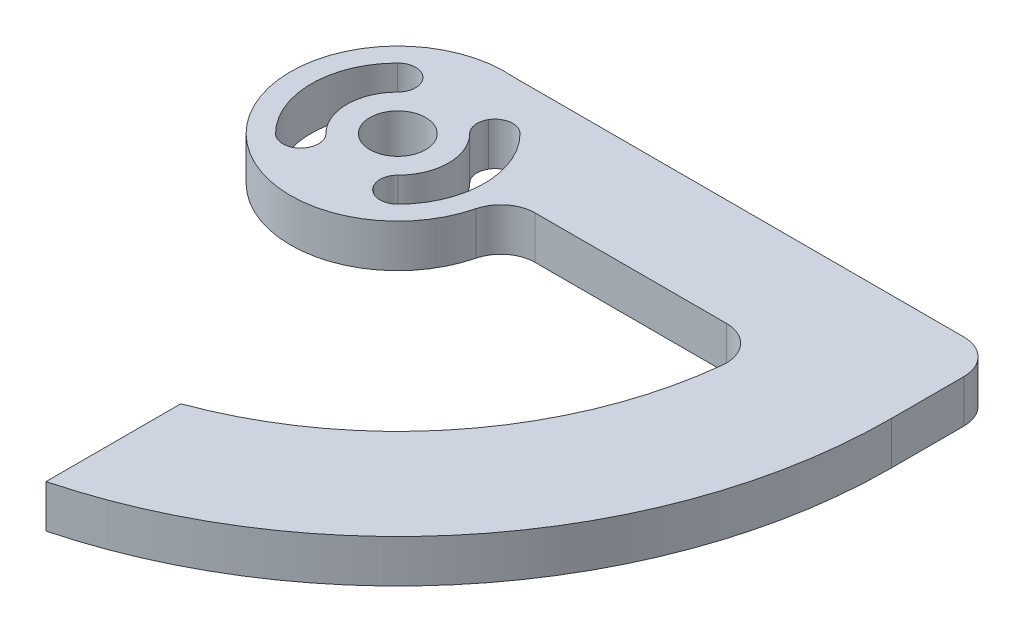
ISO-10303-21;
HEADER;
FILE_DESCRIPTION(('STEP AP214'),'2;1');
FILE_NAME('part.step','',(''),(''),'','','');
FILE_SCHEMA(('AUTOMOTIVE_DESIGN { 1 0 10303 214 1 1 1 1 }'));
ENDSEC;
DATA;
#1=APPLICATION_CONTEXT('core data for automotive mechanical design processes');
#2=APPLICATION_PROTOCOL_DEFINITION('international standard','automotive_design',2000,#1);
#3=PRODUCT_CONTEXT('',#1,'mechanical');
#4=PRODUCT('Part','Part','',(#3));
#5=PRODUCT_RELATED_PRODUCT_CATEGORY('part','',(#4));
#6=PRODUCT_DEFINITION_FORMATION('','',#4);
#7=PRODUCT_DEFINITION_CONTEXT('part definition',#1,'design');
#8=PRODUCT_DEFINITION('design','',#6,#7);
#9=PRODUCT_DEFINITION_SHAPE('','',#8);
#10=(LENGTH_UNIT() NAMED_UNIT(*) SI_UNIT(.MILLI.,.METRE.));
#11=(NAMED_UNIT(*) PLANE_ANGLE_UNIT() SI_UNIT($,.RADIAN.));
#12=(NAMED_UNIT(*) SI_UNIT($,.STERADIAN.) SOLID_ANGLE_UNIT());
#13=UNCERTAINTY_MEASURE_WITH_UNIT(LENGTH_MEASURE(1.E-05),#10,'distance_accuracy_value','');
#14=(GEOMETRIC_REPRESENTATION_CONTEXT(3) GLOBAL_UNCERTAINTY_ASSIGNED_CONTEXT((#13)) GLOBAL_UNIT_ASSIGNED_CONTEXT((#10,
#11,#12)) REPRESENTATION_CONTEXT('',''));
#15=CARTESIAN_POINT('',(0.,0.,0.));
#16=DIRECTION('',(0.,0.,1.));
#17=DIRECTION('',(1.,0.,0.));
#18=AXIS2_PLACEMENT_3D('',#15,#16,#17);
#19=CARTESIAN_POINT('',(0.,5.,0.));
#20=DIRECTION('',(0.,1.,0.));
#21=DIRECTION('',(0.,0.,1.));
#22=AXIS2_PLACEMENT_3D('',#19,#20,#21);
#23=PLANE('',#22);
#24=DIRECTION('',(0.,0.,1.));
#25=VECTOR('',#24,1.);
#26=CARTESIAN_POINT('',(14.6185852361367,5.,37.5897138926267));
#27=LINE('',#26,#25);
#28=CARTESIAN_POINT('',(14.6185852361367,5.,39.9067283261082));
#29=VERTEX_POINT('',#28);
#30=CARTESIAN_POINT('',(14.6185852361367,5.,55.6106731275014));
#31=VERTEX_POINT('',#30);
#32=EDGE_CURVE('E49',#29,#31,#27,.T.);
#33=ORIENTED_EDGE('',*,*,#32,.T.);
#34=CARTESIAN_POINT('',(0.,5.,0.));
#35=DIRECTION('',(0.,1.,0.));
#36=DIRECTION('',(1.,0.,0.));
#37=AXIS2_PLACEMENT_3D('',#34,#35,#36);
#38=CIRCLE('',#37,57.5);
#39=CARTESIAN_POINT('',(57.5,5.,0.));
#40=VERTEX_POINT('',#39);
#41=EDGE_CURVE('E198',#31,#40,#38,.T.);
#42=ORIENTED_EDGE('',*,*,#41,.T.);
#43=DIRECTION('',(0.,0.,-1.));
#44=VECTOR('',#43,1.);
#45=CARTESIAN_POINT('',(57.5,5.,0.));
#46=LINE('',#45,#44);
#47=CARTESIAN_POINT('',(57.5,5.,-8.45993579437712));
#48=VERTEX_POINT('',#47);
#49=EDGE_CURVE('E219',#40,#48,#46,.T.);
#50=ORIENTED_EDGE('',*,*,#49,.T.);
#51=CARTESIAN_POINT('',(53.5,5.,-8.45993579437712));
#52=DIRECTION('',(0.,1.,0.));
#53=DIRECTION('',(0.,0.,1.));
#54=AXIS2_PLACEMENT_3D('',#51,#52,#53);
#55=CIRCLE('',#54,4.);
#56=CARTESIAN_POINT('',(53.5,5.,-12.4599357943771));
#57=VERTEX_POINT('',#56);
#58=EDGE_CURVE('E329',#48,#57,#55,.T.);
#59=ORIENTED_EDGE('',*,*,#58,.T.);
#60=DIRECTION('',(-1.,0.,0.));
#61=VECTOR('',#60,1.);
#62=CARTESIAN_POINT('',(57.5,5.,-12.4599357943771));
#63=LINE('',#62,#61);
#64=CARTESIAN_POINT('',(0.999999999999985,5.,-12.4599357943771));
#65=VERTEX_POINT('',#64);
#66=EDGE_CURVE('E216',#57,#65,#63,.T.);
#67=ORIENTED_EDGE('',*,*,#66,.T.);
#68=CARTESIAN_POINT('',(0.,5.,0.));
#69=DIRECTION('',(0.,1.,0.));
#70=DIRECTION('',(0.,0.,1.));
#71=AXIS2_PLACEMENT_3D('',#68,#69,#70);
#72=CIRCLE('',#71,12.5);
#73=CARTESIAN_POINT('',(12.1271292375622,5.,3.03030303030303));
#74=VERTEX_POINT('',#73);
#75=EDGE_CURVE('E228',#65,#74,#72,.T.);
#76=ORIENTED_EDGE('',*,*,#75,.T.);
#77=CARTESIAN_POINT('',(16.0078105935821,5.,4.00000000000001));
#78=DIRECTION('',(0.,1.,0.));
#79=DIRECTION('',(0.,0.,1.));
#80=AXIS2_PLACEMENT_3D('',#77,#78,#79);
#81=CIRCLE('',#80,4.);
#82=CARTESIAN_POINT('',(16.0078105935821,5.,0.));
#83=VERTEX_POINT('',#82);
#84=EDGE_CURVE('E334',#74,#83,#81,.F.);
#85=ORIENTED_EDGE('',*,*,#84,.T.);
#86=DIRECTION('',(1.,0.,0.));
#87=VECTOR('',#86,1.);
#88=CARTESIAN_POINT('',(57.5,5.,0.));
#89=LINE('',#88,#87);
#90=CARTESIAN_POINT('',(38.2916439970916,5.,0.));
#91=VERTEX_POINT('',#90);
#92=EDGE_CURVE('E208',#83,#91,#89,.T.);
#93=ORIENTED_EDGE('',*,*,#92,.T.);
#94=CARTESIAN_POINT('',(38.2916439970916,5.,4.));
#95=DIRECTION('',(0.,1.,0.));
#96=DIRECTION('',(0.,0.,1.));
#97=AXIS2_PLACEMENT_3D('',#94,#95,#96);
#98=CIRCLE('',#97,4.);
#99=CARTESIAN_POINT('',(42.269996620166,5.,4.41558441558442));
#100=VERTEX_POINT('',#99);
#101=EDGE_CURVE('E43',#91,#100,#98,.F.);
#102=ORIENTED_EDGE('',*,*,#101,.T.);
#103=CARTESIAN_POINT('',(0.,5.,0.));
#104=DIRECTION('',(0.,1.,0.));
#105=DIRECTION('',(1.,0.,0.));
#106=AXIS2_PLACEMENT_3D('',#103,#104,#105);
#107=CIRCLE('',#106,42.5);
#108=EDGE_CURVE('E56',#29,#100,#107,.T.);
#109=ORIENTED_EDGE('',*,*,#108,.F.);
#110=EDGE_LOOP('',(#33,#42,#50,#59,#67,#76,#85,#93,#102,#109));
#111=FACE_BOUND('',#110,.T.);
#112=CARTESIAN_POINT('',(-5.66010946131306,5.,-5.65359716339557));
#113=DIRECTION('',(0.,1.,0.));
#114=DIRECTION('',(0.,0.,1.));
#115=AXIS2_PLACEMENT_3D('',#112,#113,#114);
#116=CIRCLE('',#115,2.075);
#117=CARTESIAN_POINT('',(-7.12820035284113,5.,-7.11999892765129));
#118=VERTEX_POINT('',#117);
#119=CARTESIAN_POINT('',(-3.86310674846034,5.,-6.69109716339556));
#120=VERTEX_POINT('',#119);
#121=EDGE_CURVE('E277',#118,#120,#116,.F.);
#122=ORIENTED_EDGE('',*,*,#121,.T.);
#123=CARTESIAN_POINT('',(-5.66010946131306,5.,-5.65359716339557));
#124=DIRECTION('',(0.,1.,0.));
#125=DIRECTION('',(0.,0.,1.));
#126=AXIS2_PLACEMENT_3D('',#123,#124,#125);
#127=CIRCLE('',#126,2.075);
#128=CARTESIAN_POINT('',(-4.19201856978498,5.,-4.18719539913984));
#129=VERTEX_POINT('',#128);
#130=EDGE_CURVE('E281',#120,#129,#127,.F.);
#131=ORIENTED_EDGE('',*,*,#130,.T.);
#132=CARTESIAN_POINT('',(0.,5.,0.));
#133=DIRECTION('',(0.,1.,0.));
#134=DIRECTION('',(0.,0.,1.));
#135=AXIS2_PLACEMENT_3D('',#132,#133,#134);
#136=CIRCLE('',#135,5.925);
#137=CARTESIAN_POINT('',(-4.19201856978499,5.,4.18719539913984));
#138=VERTEX_POINT('',#137);
#139=EDGE_CURVE('E234',#129,#138,#136,.T.);
#140=ORIENTED_EDGE('',*,*,#139,.T.);
#141=CARTESIAN_POINT('',(-5.66010946131306,5.,5.65359716339556));
#142=DIRECTION('',(0.,1.,0.));
#143=DIRECTION('',(0.,0.,1.));
#144=AXIS2_PLACEMENT_3D('',#141,#142,#143);
#145=CIRCLE('',#144,2.075);
#146=CARTESIAN_POINT('',(-3.86310674846035,5.,6.69109716339556));
#147=VERTEX_POINT('',#146);
#148=EDGE_CURVE('E297',#138,#147,#145,.F.);
#149=ORIENTED_EDGE('',*,*,#148,.T.);
#150=CARTESIAN_POINT('',(-5.66010946131306,5.,5.65359716339556));
#151=DIRECTION('',(0.,1.,0.));
#152=DIRECTION('',(0.,0.,1.));
#153=AXIS2_PLACEMENT_3D('',#150,#151,#152);
#154=CIRCLE('',#153,2.075);
#155=CARTESIAN_POINT('',(-7.12820035284114,5.,7.11999892765129));
#156=VERTEX_POINT('',#155);
#157=EDGE_CURVE('E293',#147,#156,#154,.F.);
#158=ORIENTED_EDGE('',*,*,#157,.T.);
#159=CARTESIAN_POINT('',(0.,5.,0.));
#160=DIRECTION('',(0.,1.,0.));
#161=DIRECTION('',(0.,0.,1.));
#162=AXIS2_PLACEMENT_3D('',#159,#160,#161);
#163=CIRCLE('',#162,10.075);
#164=EDGE_CURVE('E237',#118,#156,#163,.T.);
#165=ORIENTED_EDGE('',*,*,#164,.F.);
#166=EDGE_LOOP('',(#122,#131,#140,#149,#158,#165));
#167=FACE_BOUND('',#166,.T.);
#168=CARTESIAN_POINT('',(0.,5.,0.));
#169=DIRECTION('',(0.,1.,0.));
#170=DIRECTION('',(0.,0.,1.));
#171=AXIS2_PLACEMENT_3D('',#168,#169,#170);
#172=CIRCLE('',#171,3.25);
#173=CARTESIAN_POINT('',(0.,5.,3.25));
#174=VERTEX_POINT('',#173);
#175=EDGE_CURVE('E201',#174,#174,#172,.T.);
#176=ORIENTED_EDGE('',*,*,#175,.F.);
#177=EDGE_LOOP('',(#176));
#178=FACE_BOUND('',#177,.T.);
#179=CARTESIAN_POINT('',(5.66010946131306,5.,-5.65359716339557));
#180=DIRECTION('',(0.,1.,0.));
#181=DIRECTION('',(0.,0.,1.));
#182=AXIS2_PLACEMENT_3D('',#179,#180,#181);
#183=CIRCLE('',#182,2.075);
#184=CARTESIAN_POINT('',(4.19201856978498,5.,-4.18719539913984));
#185=VERTEX_POINT('',#184);
#186=CARTESIAN_POINT('',(3.86310674846034,5.,-6.69109716339556));
#187=VERTEX_POINT('',#186);
#188=EDGE_CURVE('E269',#185,#187,#183,.F.);
#189=ORIENTED_EDGE('',*,*,#188,.T.);
#190=CARTESIAN_POINT('',(5.66010946131306,5.,-5.65359716339557));
#191=DIRECTION('',(0.,1.,0.));
#192=DIRECTION('',(0.,0.,1.));
#193=AXIS2_PLACEMENT_3D('',#190,#191,#192);
#194=CIRCLE('',#193,2.075);
#195=CARTESIAN_POINT('',(7.12820035284113,5.,-7.11999892765129));
#196=VERTEX_POINT('',#195);
#197=EDGE_CURVE('E273',#187,#196,#194,.F.);
#198=ORIENTED_EDGE('',*,*,#197,.T.);
#199=CARTESIAN_POINT('',(0.,5.,0.));
#200=DIRECTION('',(0.,1.,0.));
#201=DIRECTION('',(0.,0.,1.));
#202=AXIS2_PLACEMENT_3D('',#199,#200,#201);
#203=CIRCLE('',#202,10.075);
#204=CARTESIAN_POINT('',(7.12820035284114,5.,7.11999892765129));
#205=VERTEX_POINT('',#204);
#206=EDGE_CURVE('E245',#196,#205,#203,.F.);
#207=ORIENTED_EDGE('',*,*,#206,.T.);
#208=CARTESIAN_POINT('',(5.66010946131306,5.,5.65359716339556));
#209=DIRECTION('',(0.,1.,0.));
#210=DIRECTION('',(0.,0.,1.));
#211=AXIS2_PLACEMENT_3D('',#208,#209,#210);
#212=CIRCLE('',#211,2.075);
#213=CARTESIAN_POINT('',(3.86310674846035,5.,6.69109716339556));
#214=VERTEX_POINT('',#213);
#215=EDGE_CURVE('E289',#205,#214,#212,.F.);
#216=ORIENTED_EDGE('',*,*,#215,.T.);
#217=CARTESIAN_POINT('',(5.66010946131306,5.,5.65359716339556));
#218=DIRECTION('',(0.,1.,0.));
#219=DIRECTION('',(0.,0.,1.));
#220=AXIS2_PLACEMENT_3D('',#217,#218,#219);
#221=CIRCLE('',#220,2.075);
#222=CARTESIAN_POINT('',(4.19201856978499,5.,4.18719539913984));
#223=VERTEX_POINT('',#222);
#224=EDGE_CURVE('E285',#214,#223,#221,.F.);
#225=ORIENTED_EDGE('',*,*,#224,.T.);
#226=CARTESIAN_POINT('',(0.,5.,0.));
#227=DIRECTION('',(0.,1.,0.));
#228=DIRECTION('',(0.,0.,1.));
#229=AXIS2_PLACEMENT_3D('',#226,#227,#228);
#230=CIRCLE('',#229,5.925);
#231=EDGE_CURVE('E242',#185,#223,#230,.F.);
#232=ORIENTED_EDGE('',*,*,#231,.F.);
#233=EDGE_LOOP('',(#189,#198,#207,#216,#225,#232));
#234=FACE_BOUND('',#233,.T.);
#235=ADVANCED_FACE('F35',(#111,#167,#178,#234),#23,.T.);
#236=CARTESIAN_POINT('',(0.,0.,0.));
#237=DIRECTION('',(0.,1.,0.));
#238=DIRECTION('',(0.,0.,1.));
#239=AXIS2_PLACEMENT_3D('',#236,#237,#238);
#240=PLANE('',#239);
#241=CARTESIAN_POINT('',(0.,0.,0.));
#242=DIRECTION('',(0.,1.,0.));
#243=DIRECTION('',(1.,0.,0.));
#244=AXIS2_PLACEMENT_3D('',#241,#242,#243);
#245=CIRCLE('',#244,57.5);
#246=CARTESIAN_POINT('',(14.6185852361367,0.,55.6106731275014));
#247=VERTEX_POINT('',#246);
#248=CARTESIAN_POINT('',(57.5,0.,0.));
#249=VERTEX_POINT('',#248);
#250=EDGE_CURVE('E193',#247,#249,#245,.T.);
#251=ORIENTED_EDGE('',*,*,#250,.F.);
#252=DIRECTION('',(0.,0.,1.));
#253=VECTOR('',#252,1.);
#254=CARTESIAN_POINT('',(14.6185852361367,0.,37.5897138926267));
#255=LINE('',#254,#253);
#256=CARTESIAN_POINT('',(14.6185852361367,0.,39.9067283261082));
#257=VERTEX_POINT('',#256);
#258=EDGE_CURVE('E183',#257,#247,#255,.T.);
#259=ORIENTED_EDGE('',*,*,#258,.F.);
#260=CARTESIAN_POINT('',(0.,0.,0.));
#261=DIRECTION('',(0.,1.,0.));
#262=DIRECTION('',(1.,0.,0.));
#263=AXIS2_PLACEMENT_3D('',#260,#261,#262);
#264=CIRCLE('',#263,42.5);
#265=CARTESIAN_POINT('',(42.269996620166,0.,4.41558441558442));
#266=VERTEX_POINT('',#265);
#267=EDGE_CURVE('E190',#257,#266,#264,.T.);
#268=ORIENTED_EDGE('',*,*,#267,.T.);
#269=CARTESIAN_POINT('',(38.2916439970916,0.,4.));
#270=DIRECTION('',(0.,1.,0.));
#271=DIRECTION('',(0.,0.,1.));
#272=AXIS2_PLACEMENT_3D('',#269,#270,#271);
#273=CIRCLE('',#272,4.);
#274=CARTESIAN_POINT('',(38.2916439970916,0.,0.));
#275=VERTEX_POINT('',#274);
#276=EDGE_CURVE('E336',#266,#275,#273,.T.);
#277=ORIENTED_EDGE('',*,*,#276,.T.);
#278=DIRECTION('',(1.,0.,0.));
#279=VECTOR('',#278,1.);
#280=CARTESIAN_POINT('',(57.5,0.,0.));
#281=LINE('',#280,#279);
#282=CARTESIAN_POINT('',(16.0078105935821,0.,0.));
#283=VERTEX_POINT('',#282);
#284=EDGE_CURVE('E205',#283,#275,#281,.T.);
#285=ORIENTED_EDGE('',*,*,#284,.F.);
#286=CARTESIAN_POINT('',(16.0078105935821,0.,4.00000000000001));
#287=DIRECTION('',(0.,1.,0.));
#288=DIRECTION('',(0.,0.,1.));
#289=AXIS2_PLACEMENT_3D('',#286,#287,#288);
#290=CIRCLE('',#289,4.);
#291=CARTESIAN_POINT('',(12.1271292375622,0.,3.03030303030303));
#292=VERTEX_POINT('',#291);
#293=EDGE_CURVE('E332',#283,#292,#290,.T.);
#294=ORIENTED_EDGE('',*,*,#293,.T.);
#295=CARTESIAN_POINT('',(0.,0.,0.));
#296=DIRECTION('',(0.,1.,0.));
#297=DIRECTION('',(0.,0.,1.));
#298=AXIS2_PLACEMENT_3D('',#295,#296,#297);
#299=CIRCLE('',#298,12.5);
#300=CARTESIAN_POINT('',(0.999999999999985,0.,-12.4599357943771));
#301=VERTEX_POINT('',#300);
#302=EDGE_CURVE('E218',#301,#292,#299,.T.);
#303=ORIENTED_EDGE('',*,*,#302,.F.);
#304=DIRECTION('',(-1.,0.,0.));
#305=VECTOR('',#304,1.);
#306=CARTESIAN_POINT('',(57.5,0.,-12.4599357943771));
#307=LINE('',#306,#305);
#308=CARTESIAN_POINT('',(53.5,0.,-12.4599357943771));
#309=VERTEX_POINT('',#308);
#310=EDGE_CURVE('E210',#309,#301,#307,.T.);
#311=ORIENTED_EDGE('',*,*,#310,.F.);
#312=CARTESIAN_POINT('',(53.5,0.,-8.45993579437712));
#313=DIRECTION('',(0.,1.,0.));
#314=DIRECTION('',(0.,0.,1.));
#315=AXIS2_PLACEMENT_3D('',#312,#313,#314);
#316=CIRCLE('',#315,4.);
#317=CARTESIAN_POINT('',(57.5,0.,-8.45993579437712));
#318=VERTEX_POINT('',#317);
#319=EDGE_CURVE('E325',#309,#318,#316,.F.);
#320=ORIENTED_EDGE('',*,*,#319,.T.);
#321=DIRECTION('',(0.,0.,-1.));
#322=VECTOR('',#321,1.);
#323=CARTESIAN_POINT('',(57.5,0.,0.));
#324=LINE('',#323,#322);
#325=EDGE_CURVE('E212',#249,#318,#324,.T.);
#326=ORIENTED_EDGE('',*,*,#325,.F.);
#327=EDGE_LOOP('',(#251,#259,#268,#277,#285,#294,#303,#311,#320,#326));
#328=FACE_BOUND('',#327,.T.);
#329=CARTESIAN_POINT('',(0.,0.,0.));
#330=DIRECTION('',(0.,1.,0.));
#331=DIRECTION('',(0.,0.,1.));
#332=AXIS2_PLACEMENT_3D('',#329,#330,#331);
#333=CIRCLE('',#332,3.25);
#334=CARTESIAN_POINT('',(0.,0.,3.25));
#335=VERTEX_POINT('',#334);
#336=EDGE_CURVE('E241',#335,#335,#333,.T.);
#337=ORIENTED_EDGE('',*,*,#336,.T.);
#338=EDGE_LOOP('',(#337));
#339=FACE_BOUND('',#338,.T.);
#340=CARTESIAN_POINT('',(0.,0.,0.));
#341=DIRECTION('',(0.,1.,0.));
#342=DIRECTION('',(1.,0.,0.));
#343=AXIS2_PLACEMENT_3D('',#340,#341,#342);
#344=CIRCLE('',#343,5.925);
#345=CARTESIAN_POINT('',(-4.19201856978498,0.,-4.18719539913984));
#346=VERTEX_POINT('',#345);
#347=CARTESIAN_POINT('',(-4.19201856978499,0.,4.18719539913984));
#348=VERTEX_POINT('',#347);
#349=EDGE_CURVE('E238',#346,#348,#344,.T.);
#350=ORIENTED_EDGE('',*,*,#349,.F.);
#351=CARTESIAN_POINT('',(-5.66010946131306,0.,-5.65359716339557));
#352=DIRECTION('',(0.,1.,0.));
#353=DIRECTION('',(0.,0.,1.));
#354=AXIS2_PLACEMENT_3D('',#351,#352,#353);
#355=CIRCLE('',#354,2.075);
#356=CARTESIAN_POINT('',(-3.86310674846034,0.,-6.69109716339556));
#357=VERTEX_POINT('',#356);
#358=EDGE_CURVE('E283',#346,#357,#355,.T.);
#359=ORIENTED_EDGE('',*,*,#358,.T.);
#360=CARTESIAN_POINT('',(-5.66010946131306,0.,-5.65359716339557));
#361=DIRECTION('',(0.,1.,0.));
#362=DIRECTION('',(0.,0.,1.));
#363=AXIS2_PLACEMENT_3D('',#360,#361,#362);
#364=CIRCLE('',#363,2.075);
#365=CARTESIAN_POINT('',(-7.12820035284113,0.,-7.11999892765129));
#366=VERTEX_POINT('',#365);
#367=EDGE_CURVE('E279',#357,#366,#364,.T.);
#368=ORIENTED_EDGE('',*,*,#367,.T.);
#369=CARTESIAN_POINT('',(0.,0.,0.));
#370=DIRECTION('',(0.,1.,0.));
#371=DIRECTION('',(1.,0.,0.));
#372=AXIS2_PLACEMENT_3D('',#369,#370,#371);
#373=CIRCLE('',#372,10.075);
#374=CARTESIAN_POINT('',(-7.12820035284114,0.,7.11999892765129));
#375=VERTEX_POINT('',#374);
#376=EDGE_CURVE('E249',#366,#375,#373,.T.);
#377=ORIENTED_EDGE('',*,*,#376,.T.);
#378=CARTESIAN_POINT('',(-5.66010946131306,0.,5.65359716339556));
#379=DIRECTION('',(0.,1.,0.));
#380=DIRECTION('',(0.,0.,1.));
#381=AXIS2_PLACEMENT_3D('',#378,#379,#380);
#382=CIRCLE('',#381,2.075);
#383=CARTESIAN_POINT('',(-3.86310674846035,0.,6.69109716339556));
#384=VERTEX_POINT('',#383);
#385=EDGE_CURVE('E295',#375,#384,#382,.T.);
#386=ORIENTED_EDGE('',*,*,#385,.T.);
#387=CARTESIAN_POINT('',(-5.66010946131306,0.,5.65359716339556));
#388=DIRECTION('',(0.,1.,0.));
#389=DIRECTION('',(0.,0.,1.));
#390=AXIS2_PLACEMENT_3D('',#387,#388,#389);
#391=CIRCLE('',#390,2.075);
#392=EDGE_CURVE('E299',#384,#348,#391,.T.);
#393=ORIENTED_EDGE('',*,*,#392,.T.);
#394=EDGE_LOOP('',(#350,#359,#368,#377,#386,#393));
#395=FACE_BOUND('',#394,.T.);
#396=CARTESIAN_POINT('',(0.,0.,0.));
#397=DIRECTION('',(0.,-1.,0.));
#398=DIRECTION('',(-1.,0.,0.));
#399=AXIS2_PLACEMENT_3D('',#396,#397,#398);
#400=CIRCLE('',#399,10.075);
#401=CARTESIAN_POINT('',(7.12820035284113,0.,-7.11999892765129));
#402=VERTEX_POINT('',#401);
#403=CARTESIAN_POINT('',(7.12820035284114,0.,7.11999892765129));
#404=VERTEX_POINT('',#403);
#405=EDGE_CURVE('E305',#402,#404,#400,.T.);
#406=ORIENTED_EDGE('',*,*,#405,.F.);
#407=CARTESIAN_POINT('',(5.66010946131306,0.,-5.65359716339557));
#408=DIRECTION('',(0.,1.,0.));
#409=DIRECTION('',(0.,0.,1.));
#410=AXIS2_PLACEMENT_3D('',#407,#408,#409);
#411=CIRCLE('',#410,2.075);
#412=CARTESIAN_POINT('',(3.86310674846034,0.,-6.69109716339556));
#413=VERTEX_POINT('',#412);
#414=EDGE_CURVE('E275',#402,#413,#411,.T.);
#415=ORIENTED_EDGE('',*,*,#414,.T.);
#416=CARTESIAN_POINT('',(5.66010946131306,0.,-5.65359716339557));
#417=DIRECTION('',(0.,1.,0.));
#418=DIRECTION('',(0.,0.,1.));
#419=AXIS2_PLACEMENT_3D('',#416,#417,#418);
#420=CIRCLE('',#419,2.075);
#421=CARTESIAN_POINT('',(4.19201856978498,0.,-4.18719539913984));
#422=VERTEX_POINT('',#421);
#423=EDGE_CURVE('E271',#413,#422,#420,.T.);
#424=ORIENTED_EDGE('',*,*,#423,.T.);
#425=CARTESIAN_POINT('',(0.,0.,0.));
#426=DIRECTION('',(0.,-1.,0.));
#427=DIRECTION('',(-1.,0.,0.));
#428=AXIS2_PLACEMENT_3D('',#425,#426,#427);
#429=CIRCLE('',#428,5.925);
#430=CARTESIAN_POINT('',(4.19201856978499,0.,4.18719539913984));
#431=VERTEX_POINT('',#430);
#432=EDGE_CURVE('E246',#422,#431,#429,.T.);
#433=ORIENTED_EDGE('',*,*,#432,.T.);
#434=CARTESIAN_POINT('',(5.66010946131306,0.,5.65359716339556));
#435=DIRECTION('',(0.,1.,0.));
#436=DIRECTION('',(0.,0.,1.));
#437=AXIS2_PLACEMENT_3D('',#434,#435,#436);
#438=CIRCLE('',#437,2.075);
#439=CARTESIAN_POINT('',(3.86310674846035,0.,6.69109716339556));
#440=VERTEX_POINT('',#439);
#441=EDGE_CURVE('E287',#431,#440,#438,.T.);
#442=ORIENTED_EDGE('',*,*,#441,.T.);
#443=CARTESIAN_POINT('',(5.66010946131306,0.,5.65359716339556));
#444=DIRECTION('',(0.,1.,0.));
#445=DIRECTION('',(0.,0.,1.));
#446=AXIS2_PLACEMENT_3D('',#443,#444,#445);
#447=CIRCLE('',#446,2.075);
#448=EDGE_CURVE('E291',#440,#404,#447,.T.);
#449=ORIENTED_EDGE('',*,*,#448,.T.);
#450=EDGE_LOOP('',(#406,#415,#424,#433,#442,#449));
#451=FACE_BOUND('',#450,.T.);
#452=ADVANCED_FACE('F188',(#328,#339,#395,#451),#240,.F.);
#453=CARTESIAN_POINT('',(0.,5.,0.));
#454=DIRECTION('',(0.,-1.,0.));
#455=DIRECTION('',(0.,0.,-1.));
#456=AXIS2_PLACEMENT_3D('',#453,#454,#455);
#457=CYLINDRICAL_SURFACE('',#456,12.5);
#458=ORIENTED_EDGE('',*,*,#302,.T.);
#459=DIRECTION('',(0.,-1.,0.));
#460=VECTOR('',#459,1.);
#461=CARTESIAN_POINT('',(12.1271292375622,5.,3.03030303030303));
#462=LINE('',#461,#460);
#463=EDGE_CURVE('E320',#292,#74,#462,.F.);
#464=ORIENTED_EDGE('',*,*,#463,.T.);
#465=ORIENTED_EDGE('',*,*,#75,.F.);
#466=DIRECTION('',(0.,-1.,0.));
#467=VECTOR('',#466,1.);
#468=CARTESIAN_POINT('',(0.999999999999985,62.8575837725704,-12.4599357943771));
#469=LINE('',#468,#467);
#470=EDGE_CURVE('E209',#65,#301,#469,.T.);
#471=ORIENTED_EDGE('',*,*,#470,.T.);
#472=EDGE_LOOP('',(#458,#464,#465,#471));
#473=FACE_BOUND('',#472,.T.);
#474=ADVANCED_FACE('F354',(#473),#457,.T.);
#475=CARTESIAN_POINT('',(57.5,62.8575837725704,0.));
#476=DIRECTION('',(0.,0.,-1.));
#477=DIRECTION('',(-1.,0.,0.));
#478=AXIS2_PLACEMENT_3D('',#475,#476,#477);
#479=PLANE('',#478);
#480=ORIENTED_EDGE('',*,*,#92,.F.);
#481=DIRECTION('',(0.,1.,0.));
#482=VECTOR('',#481,1.);
#483=CARTESIAN_POINT('',(16.0078105935821,0.,0.));
#484=LINE('',#483,#482);
#485=EDGE_CURVE('E317',#83,#283,#484,.F.);
#486=ORIENTED_EDGE('',*,*,#485,.T.);
#487=ORIENTED_EDGE('',*,*,#284,.T.);
#488=DIRECTION('',(0.,-1.,0.));
#489=VECTOR('',#488,1.);
#490=CARTESIAN_POINT('',(38.2916439970916,62.8575837725704,0.));
#491=LINE('',#490,#489);
#492=EDGE_CURVE('E301',#275,#91,#491,.F.);
#493=ORIENTED_EDGE('',*,*,#492,.T.);
#494=EDGE_LOOP('',(#480,#486,#487,#493));
#495=FACE_BOUND('',#494,.T.);
#496=ADVANCED_FACE('F345',(#495),#479,.F.);
#497=CARTESIAN_POINT('',(57.5,62.8575837725704,0.));
#498=DIRECTION('',(-1.,0.,0.));
#499=DIRECTION('',(0.,0.,1.));
#500=AXIS2_PLACEMENT_3D('',#497,#498,#499);
#501=PLANE('',#500);
#502=ORIENTED_EDGE('',*,*,#325,.T.);
#503=DIRECTION('',(0.,-1.,0.));
#504=VECTOR('',#503,1.);
#505=CARTESIAN_POINT('',(57.5,62.8575837725704,-8.45993579437712));
#506=LINE('',#505,#504);
#507=EDGE_CURVE('E327',#318,#48,#506,.F.);
#508=ORIENTED_EDGE('',*,*,#507,.T.);
#509=ORIENTED_EDGE('',*,*,#49,.F.);
#510=DIRECTION('',(0.,-1.,0.));
#511=VECTOR('',#510,1.);
#512=CARTESIAN_POINT('',(57.5,62.8575837725704,0.));
#513=LINE('',#512,#511);
#514=EDGE_CURVE('E215',#40,#249,#513,.T.);
#515=ORIENTED_EDGE('',*,*,#514,.T.);
#516=EDGE_LOOP('',(#502,#508,#509,#515));
#517=FACE_BOUND('',#516,.T.);
#518=ADVANCED_FACE('F364',(#517),#501,.F.);
#519=CARTESIAN_POINT('',(57.5,62.8575837725704,-12.4599357943771));
#520=DIRECTION('',(0.,0.,1.));
#521=DIRECTION('',(1.,0.,0.));
#522=AXIS2_PLACEMENT_3D('',#519,#520,#521);
#523=PLANE('',#522);
#524=ORIENTED_EDGE('',*,*,#66,.F.);
#525=DIRECTION('',(0.,-1.,0.));
#526=VECTOR('',#525,1.);
#527=CARTESIAN_POINT('',(53.5,62.8575837725704,-12.4599357943771));
#528=LINE('',#527,#526);
#529=EDGE_CURVE('E322',#57,#309,#528,.T.);
#530=ORIENTED_EDGE('',*,*,#529,.T.);
#531=ORIENTED_EDGE('',*,*,#310,.T.);
#532=ORIENTED_EDGE('',*,*,#470,.F.);
#533=EDGE_LOOP('',(#524,#530,#531,#532));
#534=FACE_BOUND('',#533,.T.);
#535=ADVANCED_FACE('F359',(#534),#523,.F.);
#536=CARTESIAN_POINT('',(0.,5.,0.));
#537=DIRECTION('',(0.,-1.,0.));
#538=DIRECTION('',(0.,0.,-1.));
#539=AXIS2_PLACEMENT_3D('',#536,#537,#538);
#540=CYLINDRICAL_SURFACE('',#539,57.5);
#541=ORIENTED_EDGE('',*,*,#41,.F.);
#542=DIRECTION('',(0.,-1.,0.));
#543=VECTOR('',#542,1.);
#544=CARTESIAN_POINT('',(14.6185852361367,5.,55.6106731275014));
#545=LINE('',#544,#543);
#546=EDGE_CURVE('E315',#31,#247,#545,.T.);
#547=ORIENTED_EDGE('',*,*,#546,.T.);
#548=ORIENTED_EDGE('',*,*,#250,.T.);
#549=ORIENTED_EDGE('',*,*,#514,.F.);
#550=EDGE_LOOP('',(#541,#547,#548,#549));
#551=FACE_BOUND('',#550,.T.);
#552=ADVANCED_FACE('F371',(#551),#540,.T.);
#553=CARTESIAN_POINT('',(0.,5.,0.));
#554=DIRECTION('',(0.,-1.,0.));
#555=DIRECTION('',(0.,0.,-1.));
#556=AXIS2_PLACEMENT_3D('',#553,#554,#555);
#557=CYLINDRICAL_SURFACE('',#556,42.5);
#558=DIRECTION('',(0.,-1.,0.));
#559=VECTOR('',#558,1.);
#560=CARTESIAN_POINT('',(14.6185852361367,5.,39.9067283261082));
#561=LINE('',#560,#559);
#562=EDGE_CURVE('E11',#29,#257,#561,.T.);
#563=ORIENTED_EDGE('',*,*,#562,.F.);
#564=ORIENTED_EDGE('',*,*,#108,.T.);
#565=DIRECTION('',(0.,-1.,0.));
#566=VECTOR('',#565,1.);
#567=CARTESIAN_POINT('',(42.269996620166,5.,4.41558441558442));
#568=LINE('',#567,#566);
#569=EDGE_CURVE('E197',#100,#266,#568,.T.);
#570=ORIENTED_EDGE('',*,*,#569,.T.);
#571=ORIENTED_EDGE('',*,*,#267,.F.);
#572=EDGE_LOOP('',(#563,#564,#570,#571));
#573=FACE_BOUND('',#572,.T.);
#574=ADVANCED_FACE('F195',(#573),#557,.F.);
#575=CARTESIAN_POINT('',(0.,0.,0.));
#576=DIRECTION('',(0.,1.,0.));
#577=DIRECTION('',(0.,0.,1.));
#578=AXIS2_PLACEMENT_3D('',#575,#576,#577);
#579=CYLINDRICAL_SURFACE('',#578,3.25);
#580=ORIENTED_EDGE('',*,*,#175,.T.);
#581=EDGE_LOOP('',(#580));
#582=FACE_BOUND('',#581,.T.);
#583=ORIENTED_EDGE('',*,*,#336,.F.);
#584=EDGE_LOOP('',(#583));
#585=FACE_BOUND('',#584,.T.);
#586=ADVANCED_FACE('F388',(#582,#585),#579,.F.);
#587=CARTESIAN_POINT('',(0.,0.,0.));
#588=DIRECTION('',(0.,1.,0.));
#589=DIRECTION('',(0.,0.,1.));
#590=AXIS2_PLACEMENT_3D('',#587,#588,#589);
#591=CYLINDRICAL_SURFACE('',#590,10.075);
#592=ORIENTED_EDGE('',*,*,#376,.F.);
#593=DIRECTION('',(0.,1.,0.));
#594=VECTOR('',#593,1.);
#595=CARTESIAN_POINT('',(-7.12820035284113,0.,-7.11999892765129));
#596=LINE('',#595,#594);
#597=EDGE_CURVE('E262',#366,#118,#596,.T.);
#598=ORIENTED_EDGE('',*,*,#597,.T.);
#599=ORIENTED_EDGE('',*,*,#164,.T.);
#600=DIRECTION('',(0.,1.,0.));
#601=VECTOR('',#600,1.);
#602=CARTESIAN_POINT('',(-7.12820035284114,0.,7.11999892765129));
#603=LINE('',#602,#601);
#604=EDGE_CURVE('E259',#156,#375,#603,.F.);
#605=ORIENTED_EDGE('',*,*,#604,.T.);
#606=EDGE_LOOP('',(#592,#598,#599,#605));
#607=FACE_BOUND('',#606,.T.);
#608=ADVANCED_FACE('F431',(#607),#591,.F.);
#609=CARTESIAN_POINT('',(0.,0.,0.));
#610=DIRECTION('',(0.,1.,0.));
#611=DIRECTION('',(0.,0.,1.));
#612=AXIS2_PLACEMENT_3D('',#609,#610,#611);
#613=CYLINDRICAL_SURFACE('',#612,5.925);
#614=ORIENTED_EDGE('',*,*,#139,.F.);
#615=DIRECTION('',(0.,1.,0.));
#616=VECTOR('',#615,1.);
#617=CARTESIAN_POINT('',(-4.19201856978498,0.,-4.18719539913984));
#618=LINE('',#617,#616);
#619=EDGE_CURVE('E267',#129,#346,#618,.F.);
#620=ORIENTED_EDGE('',*,*,#619,.T.);
#621=ORIENTED_EDGE('',*,*,#349,.T.);
#622=DIRECTION('',(0.,1.,0.));
#623=VECTOR('',#622,1.);
#624=CARTESIAN_POINT('',(-4.19201856978499,0.,4.18719539913984));
#625=LINE('',#624,#623);
#626=EDGE_CURVE('E265',#348,#138,#625,.T.);
#627=ORIENTED_EDGE('',*,*,#626,.T.);
#628=EDGE_LOOP('',(#614,#620,#621,#627));
#629=FACE_BOUND('',#628,.T.);
#630=ADVANCED_FACE('F424',(#629),#613,.T.);
#631=CARTESIAN_POINT('',(0.,0.,0.));
#632=DIRECTION('',(0.,1.,0.));
#633=DIRECTION('',(0.,0.,1.));
#634=AXIS2_PLACEMENT_3D('',#631,#632,#633);
#635=CYLINDRICAL_SURFACE('',#634,10.075);
#636=ORIENTED_EDGE('',*,*,#206,.F.);
#637=DIRECTION('',(0.,1.,0.));
#638=VECTOR('',#637,1.);
#639=CARTESIAN_POINT('',(7.12820035284113,0.,-7.11999892765129));
#640=LINE('',#639,#638);
#641=EDGE_CURVE('E257',#196,#402,#640,.F.);
#642=ORIENTED_EDGE('',*,*,#641,.T.);
#643=ORIENTED_EDGE('',*,*,#405,.T.);
#644=DIRECTION('',(0.,1.,0.));
#645=VECTOR('',#644,1.);
#646=CARTESIAN_POINT('',(7.12820035284114,0.,7.11999892765129));
#647=LINE('',#646,#645);
#648=EDGE_CURVE('E255',#404,#205,#647,.T.);
#649=ORIENTED_EDGE('',*,*,#648,.T.);
#650=EDGE_LOOP('',(#636,#642,#643,#649));
#651=FACE_BOUND('',#650,.T.);
#652=ADVANCED_FACE('F422',(#651),#635,.F.);
#653=CARTESIAN_POINT('',(0.,0.,0.));
#654=DIRECTION('',(0.,1.,0.));
#655=DIRECTION('',(0.,0.,1.));
#656=AXIS2_PLACEMENT_3D('',#653,#654,#655);
#657=CYLINDRICAL_SURFACE('',#656,5.925);
#658=ORIENTED_EDGE('',*,*,#432,.F.);
#659=DIRECTION('',(0.,1.,0.));
#660=VECTOR('',#659,1.);
#661=CARTESIAN_POINT('',(4.19201856978498,0.,-4.18719539913984));
#662=LINE('',#661,#660);
#663=EDGE_CURVE('E252',#422,#185,#662,.T.);
#664=ORIENTED_EDGE('',*,*,#663,.T.);
#665=ORIENTED_EDGE('',*,*,#231,.T.);
#666=DIRECTION('',(0.,1.,0.));
#667=VECTOR('',#666,1.);
#668=CARTESIAN_POINT('',(4.19201856978499,0.,4.18719539913984));
#669=LINE('',#668,#667);
#670=EDGE_CURVE('E231',#223,#431,#669,.F.);
#671=ORIENTED_EDGE('',*,*,#670,.T.);
#672=EDGE_LOOP('',(#658,#664,#665,#671));
#673=FACE_BOUND('',#672,.T.);
#674=ADVANCED_FACE('F410',(#673),#657,.T.);
#675=CARTESIAN_POINT('',(5.66010946131306,0.,-5.65359716339557));
#676=DIRECTION('',(0.,1.,0.));
#677=DIRECTION('',(0.,0.,1.));
#678=AXIS2_PLACEMENT_3D('',#675,#676,#677);
#679=CYLINDRICAL_SURFACE('',#678,2.075);
#680=DIRECTION('',(0.,1.,0.));
#681=VECTOR('',#680,1.);
#682=CARTESIAN_POINT('',(3.86310674846034,0.,-6.69109716339556));
#683=LINE('',#682,#681);
#684=EDGE_CURVE('E302',#413,#187,#683,.T.);
#685=ORIENTED_EDGE('',*,*,#684,.F.);
#686=ORIENTED_EDGE('',*,*,#414,.F.);
#687=ORIENTED_EDGE('',*,*,#641,.F.);
#688=ORIENTED_EDGE('',*,*,#197,.F.);
#689=EDGE_LOOP('',(#685,#686,#687,#688));
#690=FACE_BOUND('',#689,.T.);
#691=ADVANCED_FACE('F402',(#690),#679,.F.);
#692=CARTESIAN_POINT('',(5.66010946131306,0.,-5.65359716339557));
#693=DIRECTION('',(0.,1.,0.));
#694=DIRECTION('',(0.,0.,1.));
#695=AXIS2_PLACEMENT_3D('',#692,#693,#694);
#696=CYLINDRICAL_SURFACE('',#695,2.075);
#697=ORIENTED_EDGE('',*,*,#423,.F.);
#698=ORIENTED_EDGE('',*,*,#684,.T.);
#699=ORIENTED_EDGE('',*,*,#188,.F.);
#700=ORIENTED_EDGE('',*,*,#663,.F.);
#701=EDGE_LOOP('',(#697,#698,#699,#700));
#702=FACE_BOUND('',#701,.T.);
#703=ADVANCED_FACE('F405',(#702),#696,.F.);
#704=CARTESIAN_POINT('',(-5.66010946131306,0.,-5.65359716339557));
#705=DIRECTION('',(0.,1.,0.));
#706=DIRECTION('',(0.,0.,1.));
#707=AXIS2_PLACEMENT_3D('',#704,#705,#706);
#708=CYLINDRICAL_SURFACE('',#707,2.075);
#709=DIRECTION('',(0.,-1.,0.));
#710=VECTOR('',#709,1.);
#711=CARTESIAN_POINT('',(-3.86310674846034,5.,-6.69109716339556));
#712=LINE('',#711,#710);
#713=EDGE_CURVE('E306',#357,#120,#712,.F.);
#714=ORIENTED_EDGE('',*,*,#713,.F.);
#715=ORIENTED_EDGE('',*,*,#358,.F.);
#716=ORIENTED_EDGE('',*,*,#619,.F.);
#717=ORIENTED_EDGE('',*,*,#130,.F.);
#718=EDGE_LOOP('',(#714,#715,#716,#717));
#719=FACE_BOUND('',#718,.T.);
#720=ADVANCED_FACE('F457',(#719),#708,.F.);
#721=CARTESIAN_POINT('',(-5.66010946131306,0.,-5.65359716339557));
#722=DIRECTION('',(0.,1.,0.));
#723=DIRECTION('',(0.,0.,1.));
#724=AXIS2_PLACEMENT_3D('',#721,#722,#723);
#725=CYLINDRICAL_SURFACE('',#724,2.075);
#726=ORIENTED_EDGE('',*,*,#367,.F.);
#727=ORIENTED_EDGE('',*,*,#713,.T.);
#728=ORIENTED_EDGE('',*,*,#121,.F.);
#729=ORIENTED_EDGE('',*,*,#597,.F.);
#730=EDGE_LOOP('',(#726,#727,#728,#729));
#731=FACE_BOUND('',#730,.T.);
#732=ADVANCED_FACE('F460',(#731),#725,.F.);
#733=CARTESIAN_POINT('',(5.66010946131306,0.,5.65359716339556));
#734=DIRECTION('',(0.,1.,0.));
#735=DIRECTION('',(0.,0.,1.));
#736=AXIS2_PLACEMENT_3D('',#733,#734,#735);
#737=CYLINDRICAL_SURFACE('',#736,2.075);
#738=ORIENTED_EDGE('',*,*,#648,.F.);
#739=ORIENTED_EDGE('',*,*,#448,.F.);
#740=DIRECTION('',(0.,1.,0.));
#741=VECTOR('',#740,1.);
#742=CARTESIAN_POINT('',(3.86310674846035,0.,6.69109716339556));
#743=LINE('',#742,#741);
#744=EDGE_CURVE('E309',#214,#440,#743,.F.);
#745=ORIENTED_EDGE('',*,*,#744,.F.);
#746=ORIENTED_EDGE('',*,*,#215,.F.);
#747=EDGE_LOOP('',(#738,#739,#745,#746));
#748=FACE_BOUND('',#747,.T.);
#749=ADVANCED_FACE('F419',(#748),#737,.F.);
#750=CARTESIAN_POINT('',(5.66010946131306,0.,5.65359716339556));
#751=DIRECTION('',(0.,1.,0.));
#752=DIRECTION('',(0.,0.,1.));
#753=AXIS2_PLACEMENT_3D('',#750,#751,#752);
#754=CYLINDRICAL_SURFACE('',#753,2.075);
#755=ORIENTED_EDGE('',*,*,#441,.F.);
#756=ORIENTED_EDGE('',*,*,#670,.F.);
#757=ORIENTED_EDGE('',*,*,#224,.F.);
#758=ORIENTED_EDGE('',*,*,#744,.T.);
#759=EDGE_LOOP('',(#755,#756,#757,#758));
#760=FACE_BOUND('',#759,.T.);
#761=ADVANCED_FACE('F414',(#760),#754,.F.);
#762=CARTESIAN_POINT('',(-5.66010946131306,0.,5.65359716339556));
#763=DIRECTION('',(0.,1.,0.));
#764=DIRECTION('',(0.,0.,1.));
#765=AXIS2_PLACEMENT_3D('',#762,#763,#764);
#766=CYLINDRICAL_SURFACE('',#765,2.075);
#767=ORIENTED_EDGE('',*,*,#626,.F.);
#768=ORIENTED_EDGE('',*,*,#392,.F.);
#769=DIRECTION('',(0.,-1.,0.));
#770=VECTOR('',#769,1.);
#771=CARTESIAN_POINT('',(-3.86310674846035,0.,6.69109716339556));
#772=LINE('',#771,#770);
#773=EDGE_CURVE('E312',#147,#384,#772,.T.);
#774=ORIENTED_EDGE('',*,*,#773,.F.);
#775=ORIENTED_EDGE('',*,*,#148,.F.);
#776=EDGE_LOOP('',(#767,#768,#774,#775));
#777=FACE_BOUND('',#776,.T.);
#778=ADVANCED_FACE('F469',(#777),#766,.F.);
#779=CARTESIAN_POINT('',(-5.66010946131306,0.,5.65359716339556));
#780=DIRECTION('',(0.,1.,0.));
#781=DIRECTION('',(0.,0.,1.));
#782=AXIS2_PLACEMENT_3D('',#779,#780,#781);
#783=CYLINDRICAL_SURFACE('',#782,2.075);
#784=ORIENTED_EDGE('',*,*,#385,.F.);
#785=ORIENTED_EDGE('',*,*,#604,.F.);
#786=ORIENTED_EDGE('',*,*,#157,.F.);
#787=ORIENTED_EDGE('',*,*,#773,.T.);
#788=EDGE_LOOP('',(#784,#785,#786,#787));
#789=FACE_BOUND('',#788,.T.);
#790=ADVANCED_FACE('F472',(#789),#783,.F.);
#791=CARTESIAN_POINT('',(16.0078105935821,5.,4.00000000000001));
#792=DIRECTION('',(0.,-1.,0.));
#793=DIRECTION('',(0.,0.,-1.));
#794=AXIS2_PLACEMENT_3D('',#791,#792,#793);
#795=CYLINDRICAL_SURFACE('',#794,4.);
#796=ORIENTED_EDGE('',*,*,#84,.F.);
#797=ORIENTED_EDGE('',*,*,#463,.F.);
#798=ORIENTED_EDGE('',*,*,#293,.F.);
#799=ORIENTED_EDGE('',*,*,#485,.F.);
#800=EDGE_LOOP('',(#796,#797,#798,#799));
#801=FACE_BOUND('',#800,.T.);
#802=ADVANCED_FACE('F349',(#801),#795,.F.);
#803=CARTESIAN_POINT('',(53.5,62.8575837725704,-8.45993579437712));
#804=DIRECTION('',(0.,-1.,0.));
#805=DIRECTION('',(0.,0.,-1.));
#806=AXIS2_PLACEMENT_3D('',#803,#804,#805);
#807=CYLINDRICAL_SURFACE('',#806,4.);
#808=ORIENTED_EDGE('',*,*,#58,.F.);
#809=ORIENTED_EDGE('',*,*,#507,.F.);
#810=ORIENTED_EDGE('',*,*,#319,.F.);
#811=ORIENTED_EDGE('',*,*,#529,.F.);
#812=EDGE_LOOP('',(#808,#809,#810,#811));
#813=FACE_BOUND('',#812,.T.);
#814=ADVANCED_FACE('F368',(#813),#807,.T.);
#815=CARTESIAN_POINT('',(38.2916439970916,5.,4.));
#816=DIRECTION('',(0.,-1.,0.));
#817=DIRECTION('',(0.,0.,-1.));
#818=AXIS2_PLACEMENT_3D('',#815,#816,#817);
#819=CYLINDRICAL_SURFACE('',#818,4.);
#820=ORIENTED_EDGE('',*,*,#101,.F.);
#821=ORIENTED_EDGE('',*,*,#492,.F.);
#822=ORIENTED_EDGE('',*,*,#276,.F.);
#823=ORIENTED_EDGE('',*,*,#569,.F.);
#824=EDGE_LOOP('',(#820,#821,#822,#823));
#825=FACE_BOUND('',#824,.T.);
#826=ADVANCED_FACE('F37',(#825),#819,.F.);
#827=CARTESIAN_POINT('',(14.6185852361367,5.,37.5897138926267));
#828=DIRECTION('',(1.,0.,0.));
#829=DIRECTION('',(0.,0.,-1.));
#830=AXIS2_PLACEMENT_3D('',#827,#828,#829);
#831=PLANE('',#830);
#832=ORIENTED_EDGE('',*,*,#32,.F.);
#833=ORIENTED_EDGE('',*,*,#562,.T.);
#834=ORIENTED_EDGE('',*,*,#258,.T.);
#835=ORIENTED_EDGE('',*,*,#546,.F.);
#836=EDGE_LOOP('',(#832,#833,#834,#835));
#837=FACE_BOUND('',#836,.T.);
#838=ADVANCED_FACE('F182',(#837),#831,.F.);
#839=CLOSED_SHELL('',(#235,#452,#474,#496,#518,#535,#552,#574,#586,#608,#630,#652,#674,#691,
#703,#720,#732,#749,#761,#778,#790,#802,#814,#826,#838));
#840=MANIFOLD_SOLID_BREP('B2',#839);
#841=ADVANCED_BREP_SHAPE_REPRESENTATION('',(#18,#840),#14);
#842=SHAPE_DEFINITION_REPRESENTATION(#9,#841);
ENDSEC;
END-ISO-10303-21;
